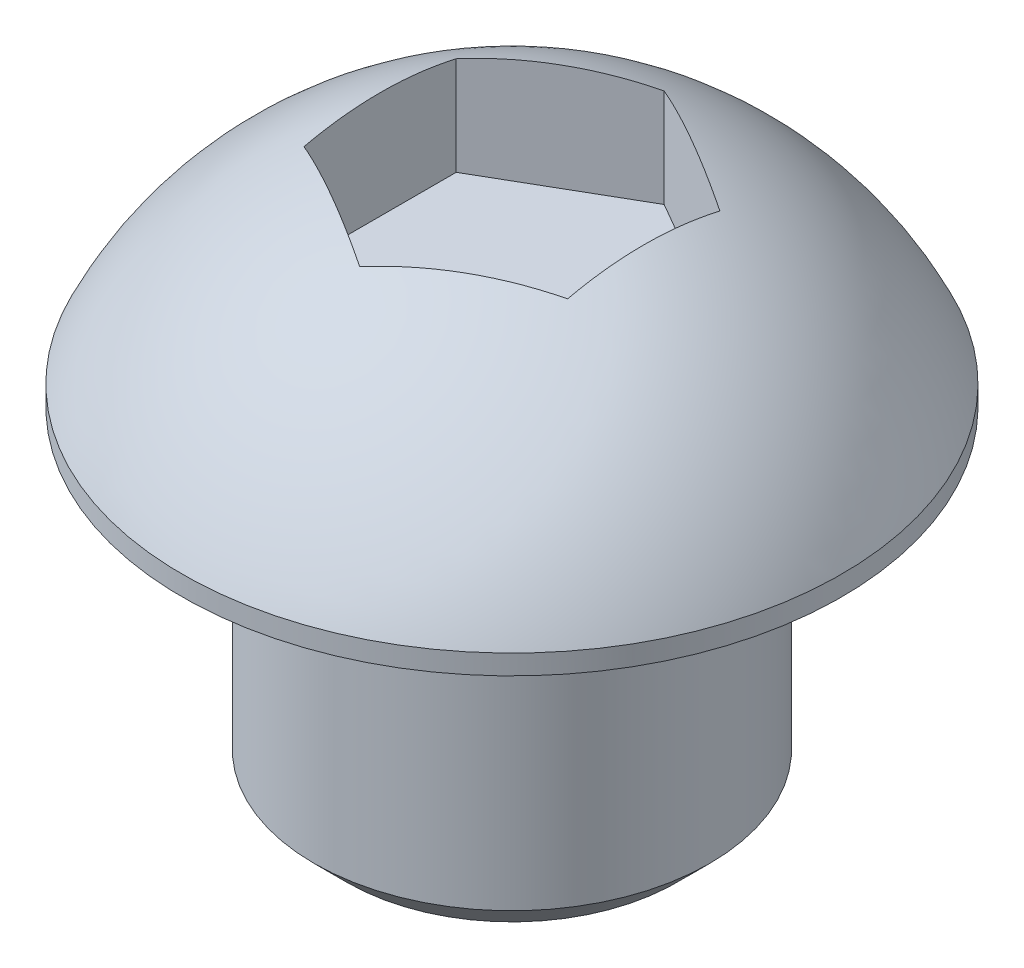
ISO-10303-21;
HEADER;
FILE_DESCRIPTION(('STEP AP214'),'2;1');
FILE_NAME('part.step','',(''),(''),'','','');
FILE_SCHEMA(('AUTOMOTIVE_DESIGN { 1 0 10303 214 1 1 1 1 }'));
ENDSEC;
DATA;
#1=APPLICATION_CONTEXT('core data for automotive mechanical design processes');
#2=APPLICATION_PROTOCOL_DEFINITION('international standard','automotive_design',2000,#1);
#3=PRODUCT_CONTEXT('',#1,'mechanical');
#4=PRODUCT('Part','Part','',(#3));
#5=PRODUCT_RELATED_PRODUCT_CATEGORY('part','',(#4));
#6=PRODUCT_DEFINITION_FORMATION('','',#4);
#7=PRODUCT_DEFINITION_CONTEXT('part definition',#1,'design');
#8=PRODUCT_DEFINITION('design','',#6,#7);
#9=PRODUCT_DEFINITION_SHAPE('','',#8);
#10=(LENGTH_UNIT() NAMED_UNIT(*) SI_UNIT(.MILLI.,.METRE.));
#11=(NAMED_UNIT(*) PLANE_ANGLE_UNIT() SI_UNIT($,.RADIAN.));
#12=(NAMED_UNIT(*) SI_UNIT($,.STERADIAN.) SOLID_ANGLE_UNIT());
#13=UNCERTAINTY_MEASURE_WITH_UNIT(LENGTH_MEASURE(1.E-05),#10,'distance_accuracy_value','');
#14=(GEOMETRIC_REPRESENTATION_CONTEXT(3) GLOBAL_UNCERTAINTY_ASSIGNED_CONTEXT((#13)) GLOBAL_UNIT_ASSIGNED_CONTEXT((#10,
#11,#12)) REPRESENTATION_CONTEXT('',''));
#15=CARTESIAN_POINT('',(0.,0.,0.));
#16=DIRECTION('',(0.,0.,1.));
#17=DIRECTION('',(1.,0.,0.));
#18=AXIS2_PLACEMENT_3D('',#15,#16,#17);
#19=CARTESIAN_POINT('',(0.,-5.,0.));
#20=DIRECTION('',(0.,1.,0.));
#21=DIRECTION('',(0.,0.,1.));
#22=AXIS2_PLACEMENT_3D('',#19,#20,#21);
#23=CYLINDRICAL_SURFACE('',#22,3.);
#24=CARTESIAN_POINT('',(0.,-4.5,0.));
#25=DIRECTION('',(0.,1.,0.));
#26=DIRECTION('',(0.,0.,1.));
#27=AXIS2_PLACEMENT_3D('',#24,#25,#26);
#28=CIRCLE('',#27,3.);
#29=CARTESIAN_POINT('',(0.,-4.5,3.));
#30=VERTEX_POINT('',#29);
#31=EDGE_CURVE('E137',#30,#30,#28,.T.);
#32=ORIENTED_EDGE('',*,*,#31,.T.);
#33=EDGE_LOOP('',(#32));
#34=FACE_BOUND('',#33,.T.);
#35=CARTESIAN_POINT('',(0.,0.,0.));
#36=DIRECTION('',(0.,1.,0.));
#37=DIRECTION('',(0.,0.,1.));
#38=AXIS2_PLACEMENT_3D('',#35,#36,#37);
#39=CIRCLE('',#38,3.);
#40=CARTESIAN_POINT('',(0.,0.,3.));
#41=VERTEX_POINT('',#40);
#42=EDGE_CURVE('E134',#41,#41,#39,.T.);
#43=ORIENTED_EDGE('',*,*,#42,.F.);
#44=EDGE_LOOP('',(#43));
#45=FACE_BOUND('',#44,.T.);
#46=ADVANCED_FACE('F36',(#34,#45),#23,.T.);
#47=CARTESIAN_POINT('',(0.,-5.,0.));
#48=DIRECTION('',(0.,1.,0.));
#49=DIRECTION('',(0.,0.,1.));
#50=AXIS2_PLACEMENT_3D('',#47,#48,#49);
#51=PLANE('',#50);
#52=CARTESIAN_POINT('',(0.,-5.,0.));
#53=DIRECTION('',(0.,1.,0.));
#54=DIRECTION('',(0.,0.,1.));
#55=AXIS2_PLACEMENT_3D('',#52,#53,#54);
#56=CIRCLE('',#55,2.5);
#57=CARTESIAN_POINT('',(0.,-5.,2.5));
#58=VERTEX_POINT('',#57);
#59=EDGE_CURVE('E140',#58,#58,#56,.F.);
#60=ORIENTED_EDGE('',*,*,#59,.T.);
#61=EDGE_LOOP('',(#60));
#62=FACE_BOUND('',#61,.T.);
#63=ADVANCED_FACE('F175',(#62),#51,.F.);
#64=CARTESIAN_POINT('',(-5.,0.,0.));
#65=DIRECTION('',(0.,1.,0.));
#66=DIRECTION('',(0.,0.,1.));
#67=AXIS2_PLACEMENT_3D('',#64,#65,#66);
#68=PLANE('',#67);
#69=ORIENTED_EDGE('',*,*,#42,.T.);
#70=EDGE_LOOP('',(#69));
#71=FACE_BOUND('',#70,.T.);
#72=CARTESIAN_POINT('',(0.,0.,0.));
#73=DIRECTION('',(0.,-1.,0.));
#74=DIRECTION('',(0.,0.,-1.));
#75=AXIS2_PLACEMENT_3D('',#72,#73,#74);
#76=CIRCLE('',#75,5.);
#77=CARTESIAN_POINT('',(0.,0.,-5.));
#78=VERTEX_POINT('',#77);
#79=EDGE_CURVE('E131',#78,#78,#76,.T.);
#80=ORIENTED_EDGE('',*,*,#79,.T.);
#81=EDGE_LOOP('',(#80));
#82=FACE_BOUND('',#81,.T.);
#83=ADVANCED_FACE('F180',(#71,#82),#68,.F.);
#84=CARTESIAN_POINT('',(0.,-2.,0.));
#85=DIRECTION('',(0.,-1.,0.));
#86=DIRECTION('',(0.,0.,-1.));
#87=AXIS2_PLACEMENT_3D('',#84,#85,#86);
#88=CYLINDRICAL_SURFACE('',#87,5.);
#89=ORIENTED_EDGE('',*,*,#79,.F.);
#90=EDGE_LOOP('',(#89));
#91=FACE_BOUND('',#90,.T.);
#92=CARTESIAN_POINT('',(0.,0.3,0.));
#93=DIRECTION('',(0.,-1.,0.));
#94=DIRECTION('',(0.,0.,-1.));
#95=AXIS2_PLACEMENT_3D('',#92,#93,#94);
#96=CIRCLE('',#95,5.);
#97=CARTESIAN_POINT('',(0.,0.3,-5.));
#98=VERTEX_POINT('',#97);
#99=EDGE_CURVE('E119',#98,#98,#96,.T.);
#100=ORIENTED_EDGE('',*,*,#99,.T.);
#101=EDGE_LOOP('',(#100));
#102=FACE_BOUND('',#101,.T.);
#103=ADVANCED_FACE('F187',(#91,#102),#88,.T.);
#104=CARTESIAN_POINT('',(0.,-2.,0.));
#105=DIRECTION('',(0.,-1.,0.));
#106=DIRECTION('',(-1.,0.,0.));
#107=AXIS2_PLACEMENT_3D('',#104,#105,#106);
#108=SPHERICAL_SURFACE('',#107,5.50363516232681);
#109=CARTESIAN_POINT('',(-1.,-2.,-1.73205080756888));
#110=DIRECTION('',(-0.5,0.,-0.866025403784439));
#111=DIRECTION('',(-0.866025403784439,0.,0.5));
#112=AXIS2_PLACEMENT_3D('',#109,#110,#111);
#113=CIRCLE('',#112,5.12737749731771);
#114=CARTESIAN_POINT('',(-2.,2.99566478725972,-1.15470053837925));
#115=VERTEX_POINT('',#114);
#116=CARTESIAN_POINT('',(0.,2.99566478725972,-2.3094010767585));
#117=VERTEX_POINT('',#116);
#118=EDGE_CURVE('E143',#115,#117,#113,.T.);
#119=ORIENTED_EDGE('',*,*,#118,.T.);
#120=CARTESIAN_POINT('',(0.999999999999999,-2.,-1.73205080756888));
#121=DIRECTION('',(0.5,0.,-0.866025403784439));
#122=DIRECTION('',(-0.866025403784439,0.,-0.5));
#123=AXIS2_PLACEMENT_3D('',#120,#121,#122);
#124=CIRCLE('',#123,5.12737749731771);
#125=CARTESIAN_POINT('',(2.,2.99566478725972,-1.15470053837925));
#126=VERTEX_POINT('',#125);
#127=EDGE_CURVE('E11',#117,#126,#124,.T.);
#128=ORIENTED_EDGE('',*,*,#127,.T.);
#129=CARTESIAN_POINT('',(2.,-2.,0.));
#130=DIRECTION('',(1.,0.,0.));
#131=DIRECTION('',(0.,0.,-1.));
#132=AXIS2_PLACEMENT_3D('',#129,#130,#131);
#133=CIRCLE('',#132,5.12737749731771);
#134=CARTESIAN_POINT('',(2.,2.99566478725972,1.15470053837925));
#135=VERTEX_POINT('',#134);
#136=EDGE_CURVE('E44',#126,#135,#133,.T.);
#137=ORIENTED_EDGE('',*,*,#136,.T.);
#138=CARTESIAN_POINT('',(1.,-2.,1.73205080756888));
#139=DIRECTION('',(0.5,0.,0.866025403784439));
#140=DIRECTION('',(0.866025403784439,0.,-0.5));
#141=AXIS2_PLACEMENT_3D('',#138,#139,#140);
#142=CIRCLE('',#141,5.12737749731771);
#143=CARTESIAN_POINT('',(0.,2.99566478725972,2.3094010767585));
#144=VERTEX_POINT('',#143);
#145=EDGE_CURVE('E151',#135,#144,#142,.T.);
#146=ORIENTED_EDGE('',*,*,#145,.T.);
#147=CARTESIAN_POINT('',(-0.999999999999999,-2.,1.73205080756888));
#148=DIRECTION('',(-0.5,0.,0.866025403784439));
#149=DIRECTION('',(0.866025403784439,0.,0.5));
#150=AXIS2_PLACEMENT_3D('',#147,#148,#149);
#151=CIRCLE('',#150,5.12737749731771);
#152=CARTESIAN_POINT('',(-2.,2.99566478725972,1.15470053837925));
#153=VERTEX_POINT('',#152);
#154=EDGE_CURVE('E148',#144,#153,#151,.T.);
#155=ORIENTED_EDGE('',*,*,#154,.T.);
#156=CARTESIAN_POINT('',(-2.,-2.,0.));
#157=DIRECTION('',(-1.,0.,0.));
#158=DIRECTION('',(0.,0.,1.));
#159=AXIS2_PLACEMENT_3D('',#156,#157,#158);
#160=CIRCLE('',#159,5.12737749731771);
#161=EDGE_CURVE('E145',#153,#115,#160,.T.);
#162=ORIENTED_EDGE('',*,*,#161,.T.);
#163=EDGE_LOOP('',(#119,#128,#137,#146,#155,#162));
#164=FACE_BOUND('',#163,.T.);
#165=ORIENTED_EDGE('',*,*,#99,.F.);
#166=EDGE_LOOP('',(#165));
#167=FACE_BOUND('',#166,.T.);
#168=ADVANCED_FACE('F154',(#164,#167),#108,.T.);
#169=CARTESIAN_POINT('',(0.,-4.5,0.));
#170=DIRECTION('',(0.,1.,0.));
#171=DIRECTION('',(0.,0.,1.));
#172=AXIS2_PLACEMENT_3D('',#169,#170,#171);
#173=CONICAL_SURFACE('',#172,3.,0.78539816339745);
#174=ORIENTED_EDGE('',*,*,#59,.F.);
#175=EDGE_LOOP('',(#174));
#176=FACE_BOUND('',#175,.T.);
#177=ORIENTED_EDGE('',*,*,#31,.F.);
#178=EDGE_LOOP('',(#177));
#179=FACE_BOUND('',#178,.T.);
#180=ADVANCED_FACE('F38',(#176,#179),#173,.T.);
#181=CARTESIAN_POINT('',(2.,1.50363516232681,-1.15470053837925));
#182=DIRECTION('',(0.5,0.,-0.866025403784439));
#183=DIRECTION('',(-0.866025403784439,0.,-0.5));
#184=AXIS2_PLACEMENT_3D('',#181,#182,#183);
#185=PLANE('',#184);
#186=DIRECTION('',(0.,1.,0.));
#187=VECTOR('',#186,1.);
#188=CARTESIAN_POINT('',(0.,1.50363516232681,-2.3094010767585));
#189=LINE('',#188,#187);
#190=CARTESIAN_POINT('',(0.,1.50363516232681,-2.3094010767585));
#191=VERTEX_POINT('',#190);
#192=EDGE_CURVE('E51',#191,#117,#189,.T.);
#193=ORIENTED_EDGE('',*,*,#192,.F.);
#194=DIRECTION('',(-0.866025403784439,0.,-0.5));
#195=VECTOR('',#194,1.);
#196=CARTESIAN_POINT('',(2.,1.50363516232681,-1.15470053837925));
#197=LINE('',#196,#195);
#198=CARTESIAN_POINT('',(2.,1.50363516232681,-1.15470053837925));
#199=VERTEX_POINT('',#198);
#200=EDGE_CURVE('E90',#199,#191,#197,.T.);
#201=ORIENTED_EDGE('',*,*,#200,.F.);
#202=DIRECTION('',(0.,1.,0.));
#203=VECTOR('',#202,1.);
#204=CARTESIAN_POINT('',(2.,1.50363516232681,-1.15470053837925));
#205=LINE('',#204,#203);
#206=EDGE_CURVE('E117',#199,#126,#205,.T.);
#207=ORIENTED_EDGE('',*,*,#206,.T.);
#208=ORIENTED_EDGE('',*,*,#127,.F.);
#209=EDGE_LOOP('',(#193,#201,#207,#208));
#210=FACE_BOUND('',#209,.T.);
#211=ADVANCED_FACE('F88',(#210),#185,.F.);
#212=CARTESIAN_POINT('',(2.,1.50363516232681,1.15470053837925));
#213=DIRECTION('',(1.,0.,0.));
#214=DIRECTION('',(0.,0.,-1.));
#215=AXIS2_PLACEMENT_3D('',#212,#213,#214);
#216=PLANE('',#215);
#217=ORIENTED_EDGE('',*,*,#206,.F.);
#218=DIRECTION('',(0.,0.,-1.));
#219=VECTOR('',#218,1.);
#220=CARTESIAN_POINT('',(2.,1.50363516232681,1.15470053837925));
#221=LINE('',#220,#219);
#222=CARTESIAN_POINT('',(2.,1.50363516232681,1.15470053837925));
#223=VERTEX_POINT('',#222);
#224=EDGE_CURVE('E94',#223,#199,#221,.T.);
#225=ORIENTED_EDGE('',*,*,#224,.F.);
#226=DIRECTION('',(0.,1.,0.));
#227=VECTOR('',#226,1.);
#228=CARTESIAN_POINT('',(2.,1.50363516232681,1.15470053837925));
#229=LINE('',#228,#227);
#230=EDGE_CURVE('E120',#223,#135,#229,.T.);
#231=ORIENTED_EDGE('',*,*,#230,.T.);
#232=ORIENTED_EDGE('',*,*,#136,.F.);
#233=EDGE_LOOP('',(#217,#225,#231,#232));
#234=FACE_BOUND('',#233,.T.);
#235=ADVANCED_FACE('F164',(#234),#216,.F.);
#236=CARTESIAN_POINT('',(0.,1.50363516232681,2.3094010767585));
#237=DIRECTION('',(0.5,0.,0.866025403784439));
#238=DIRECTION('',(0.866025403784439,0.,-0.5));
#239=AXIS2_PLACEMENT_3D('',#236,#237,#238);
#240=PLANE('',#239);
#241=ORIENTED_EDGE('',*,*,#230,.F.);
#242=DIRECTION('',(0.866025403784439,0.,-0.5));
#243=VECTOR('',#242,1.);
#244=CARTESIAN_POINT('',(0.,1.50363516232681,2.3094010767585));
#245=LINE('',#244,#243);
#246=CARTESIAN_POINT('',(0.,1.50363516232681,2.3094010767585));
#247=VERTEX_POINT('',#246);
#248=EDGE_CURVE('E114',#247,#223,#245,.T.);
#249=ORIENTED_EDGE('',*,*,#248,.F.);
#250=DIRECTION('',(0.,1.,0.));
#251=VECTOR('',#250,1.);
#252=CARTESIAN_POINT('',(0.,1.50363516232681,2.3094010767585));
#253=LINE('',#252,#251);
#254=EDGE_CURVE('E122',#247,#144,#253,.T.);
#255=ORIENTED_EDGE('',*,*,#254,.T.);
#256=ORIENTED_EDGE('',*,*,#145,.F.);
#257=EDGE_LOOP('',(#241,#249,#255,#256));
#258=FACE_BOUND('',#257,.T.);
#259=ADVANCED_FACE('F163',(#258),#240,.F.);
#260=CARTESIAN_POINT('',(-2.,1.50363516232681,1.15470053837925));
#261=DIRECTION('',(-0.5,0.,0.866025403784439));
#262=DIRECTION('',(0.866025403784439,0.,0.5));
#263=AXIS2_PLACEMENT_3D('',#260,#261,#262);
#264=PLANE('',#263);
#265=ORIENTED_EDGE('',*,*,#254,.F.);
#266=DIRECTION('',(0.866025403784439,0.,0.5));
#267=VECTOR('',#266,1.);
#268=CARTESIAN_POINT('',(-2.,1.50363516232681,1.15470053837925));
#269=LINE('',#268,#267);
#270=CARTESIAN_POINT('',(-2.,1.50363516232681,1.15470053837925));
#271=VERTEX_POINT('',#270);
#272=EDGE_CURVE('E111',#271,#247,#269,.T.);
#273=ORIENTED_EDGE('',*,*,#272,.F.);
#274=DIRECTION('',(0.,1.,0.));
#275=VECTOR('',#274,1.);
#276=CARTESIAN_POINT('',(-2.,1.50363516232681,1.15470053837925));
#277=LINE('',#276,#275);
#278=EDGE_CURVE('E125',#271,#153,#277,.T.);
#279=ORIENTED_EDGE('',*,*,#278,.T.);
#280=ORIENTED_EDGE('',*,*,#154,.F.);
#281=EDGE_LOOP('',(#265,#273,#279,#280));
#282=FACE_BOUND('',#281,.T.);
#283=ADVANCED_FACE('F161',(#282),#264,.F.);
#284=CARTESIAN_POINT('',(-2.,1.50363516232681,-1.15470053837925));
#285=DIRECTION('',(-1.,0.,0.));
#286=DIRECTION('',(0.,0.,1.));
#287=AXIS2_PLACEMENT_3D('',#284,#285,#286);
#288=PLANE('',#287);
#289=ORIENTED_EDGE('',*,*,#278,.F.);
#290=DIRECTION('',(0.,0.,1.));
#291=VECTOR('',#290,1.);
#292=CARTESIAN_POINT('',(-2.,1.50363516232681,-1.15470053837925));
#293=LINE('',#292,#291);
#294=CARTESIAN_POINT('',(-2.,1.50363516232681,-1.15470053837925));
#295=VERTEX_POINT('',#294);
#296=EDGE_CURVE('E103',#295,#271,#293,.T.);
#297=ORIENTED_EDGE('',*,*,#296,.F.);
#298=DIRECTION('',(0.,1.,0.));
#299=VECTOR('',#298,1.);
#300=CARTESIAN_POINT('',(-2.,1.50363516232681,-1.15470053837925));
#301=LINE('',#300,#299);
#302=EDGE_CURVE('E93',#295,#115,#301,.T.);
#303=ORIENTED_EDGE('',*,*,#302,.T.);
#304=ORIENTED_EDGE('',*,*,#161,.F.);
#305=EDGE_LOOP('',(#289,#297,#303,#304));
#306=FACE_BOUND('',#305,.T.);
#307=ADVANCED_FACE('F157',(#306),#288,.F.);
#308=CARTESIAN_POINT('',(0.,1.50363516232681,-2.3094010767585));
#309=DIRECTION('',(-0.5,0.,-0.866025403784439));
#310=DIRECTION('',(-0.866025403784439,0.,0.5));
#311=AXIS2_PLACEMENT_3D('',#308,#309,#310);
#312=PLANE('',#311);
#313=ORIENTED_EDGE('',*,*,#302,.F.);
#314=DIRECTION('',(-0.866025403784439,0.,0.5));
#315=VECTOR('',#314,1.);
#316=CARTESIAN_POINT('',(0.,1.50363516232681,-2.3094010767585));
#317=LINE('',#316,#315);
#318=EDGE_CURVE('E97',#191,#295,#317,.T.);
#319=ORIENTED_EDGE('',*,*,#318,.F.);
#320=ORIENTED_EDGE('',*,*,#192,.T.);
#321=ORIENTED_EDGE('',*,*,#118,.F.);
#322=EDGE_LOOP('',(#313,#319,#320,#321));
#323=FACE_BOUND('',#322,.T.);
#324=ADVANCED_FACE('F98',(#323),#312,.F.);
#325=CARTESIAN_POINT('',(0.,1.50363516232681,0.));
#326=DIRECTION('',(0.,1.,0.));
#327=DIRECTION('',(0.,0.,1.));
#328=AXIS2_PLACEMENT_3D('',#325,#326,#327);
#329=PLANE('',#328);
#330=ORIENTED_EDGE('',*,*,#200,.T.);
#331=ORIENTED_EDGE('',*,*,#318,.T.);
#332=ORIENTED_EDGE('',*,*,#296,.T.);
#333=ORIENTED_EDGE('',*,*,#272,.T.);
#334=ORIENTED_EDGE('',*,*,#248,.T.);
#335=ORIENTED_EDGE('',*,*,#224,.T.);
#336=EDGE_LOOP('',(#330,#331,#332,#333,#334,#335));
#337=FACE_BOUND('',#336,.T.);
#338=ADVANCED_FACE('F105',(#337),#329,.T.);
#339=CLOSED_SHELL('',(#46,#63,#83,#103,#168,#180,#211,#235,#259,#283,#307,#324,#338));
#340=MANIFOLD_SOLID_BREP('B2',#339);
#341=ADVANCED_BREP_SHAPE_REPRESENTATION('',(#18,#340),#14);
#342=SHAPE_DEFINITION_REPRESENTATION(#9,#341);
ENDSEC;
END-ISO-10303-21;
